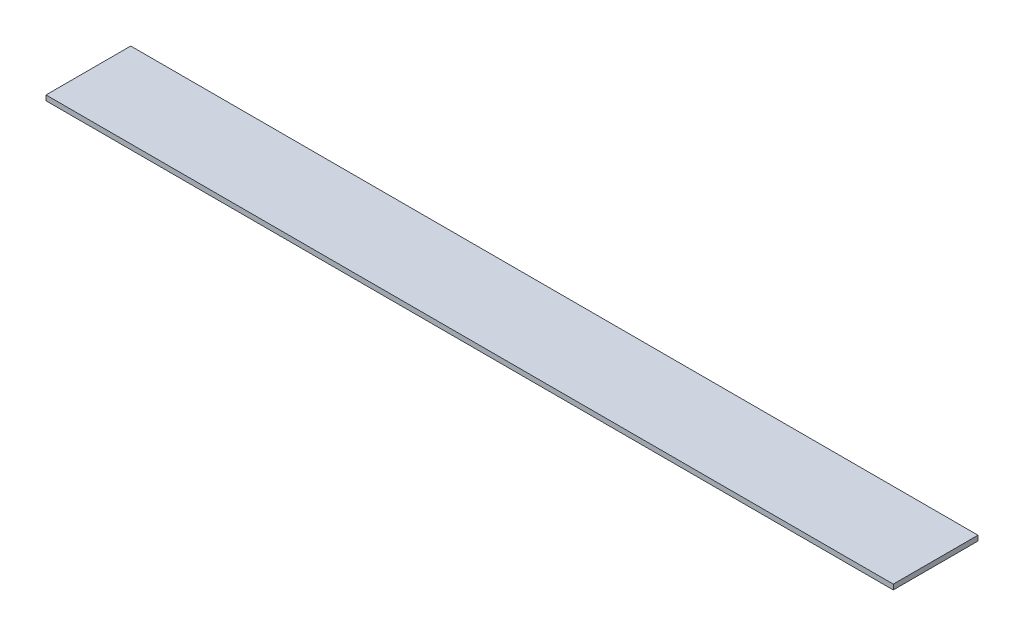
ISO-10303-21;
HEADER;
FILE_DESCRIPTION(('STEP AP214'),'2;1');
FILE_NAME('part.step','',(''),(''),'','','');
FILE_SCHEMA(('AUTOMOTIVE_DESIGN { 1 0 10303 214 1 1 1 1 }'));
ENDSEC;
DATA;
#1=APPLICATION_CONTEXT('core data for automotive mechanical design processes');
#2=APPLICATION_PROTOCOL_DEFINITION('international standard','automotive_design',2000,#1);
#3=PRODUCT_CONTEXT('',#1,'mechanical');
#4=PRODUCT('Part','Part','',(#3));
#5=PRODUCT_RELATED_PRODUCT_CATEGORY('part','',(#4));
#6=PRODUCT_DEFINITION_FORMATION('','',#4);
#7=PRODUCT_DEFINITION_CONTEXT('part definition',#1,'design');
#8=PRODUCT_DEFINITION('design','',#6,#7);
#9=PRODUCT_DEFINITION_SHAPE('','',#8);
#10=(LENGTH_UNIT() NAMED_UNIT(*) SI_UNIT(.MILLI.,.METRE.));
#11=(NAMED_UNIT(*) PLANE_ANGLE_UNIT() SI_UNIT($,.RADIAN.));
#12=(NAMED_UNIT(*) SI_UNIT($,.STERADIAN.) SOLID_ANGLE_UNIT());
#13=UNCERTAINTY_MEASURE_WITH_UNIT(LENGTH_MEASURE(1.E-05),#10,'distance_accuracy_value','');
#14=(GEOMETRIC_REPRESENTATION_CONTEXT(3) GLOBAL_UNCERTAINTY_ASSIGNED_CONTEXT((#13)) GLOBAL_UNIT_ASSIGNED_CONTEXT((#10,
#11,#12)) REPRESENTATION_CONTEXT('',''));
#15=CARTESIAN_POINT('',(0.,0.,0.));
#16=DIRECTION('',(0.,0.,1.));
#17=DIRECTION('',(1.,0.,0.));
#18=AXIS2_PLACEMENT_3D('',#15,#16,#17);
#19=CARTESIAN_POINT('',(250.,3.,-25.));
#20=DIRECTION('',(-1.,0.,0.));
#21=DIRECTION('',(0.,0.,1.));
#22=AXIS2_PLACEMENT_3D('',#19,#20,#21);
#23=PLANE('',#22);
#24=DIRECTION('',(0.,0.,-1.));
#25=VECTOR('',#24,1.);
#26=CARTESIAN_POINT('',(250.,0.,-25.));
#27=LINE('',#26,#25);
#28=CARTESIAN_POINT('',(250.,0.,25.));
#29=VERTEX_POINT('',#28);
#30=CARTESIAN_POINT('',(250.,0.,-25.));
#31=VERTEX_POINT('',#30);
#32=EDGE_CURVE('E96',#29,#31,#27,.T.);
#33=ORIENTED_EDGE('',*,*,#32,.T.);
#34=DIRECTION('',(0.,-1.,0.));
#35=VECTOR('',#34,1.);
#36=CARTESIAN_POINT('',(250.,3.,-25.));
#37=LINE('',#36,#35);
#38=CARTESIAN_POINT('',(250.,3.,-25.));
#39=VERTEX_POINT('',#38);
#40=EDGE_CURVE('E11',#39,#31,#37,.T.);
#41=ORIENTED_EDGE('',*,*,#40,.F.);
#42=DIRECTION('',(0.,0.,-1.));
#43=VECTOR('',#42,1.);
#44=CARTESIAN_POINT('',(250.,3.,-25.));
#45=LINE('',#44,#43);
#46=CARTESIAN_POINT('',(250.,3.,25.));
#47=VERTEX_POINT('',#46);
#48=EDGE_CURVE('E84',#47,#39,#45,.T.);
#49=ORIENTED_EDGE('',*,*,#48,.F.);
#50=DIRECTION('',(0.,-1.,0.));
#51=VECTOR('',#50,1.);
#52=CARTESIAN_POINT('',(250.,3.,25.));
#53=LINE('',#52,#51);
#54=EDGE_CURVE('E92',#47,#29,#53,.T.);
#55=ORIENTED_EDGE('',*,*,#54,.T.);
#56=EDGE_LOOP('',(#33,#41,#49,#55));
#57=FACE_BOUND('',#56,.T.);
#58=ADVANCED_FACE('F33',(#57),#23,.F.);
#59=CARTESIAN_POINT('',(-250.,3.,-25.));
#60=DIRECTION('',(0.,0.,1.));
#61=DIRECTION('',(1.,0.,0.));
#62=AXIS2_PLACEMENT_3D('',#59,#60,#61);
#63=PLANE('',#62);
#64=DIRECTION('',(-1.,0.,0.));
#65=VECTOR('',#64,1.);
#66=CARTESIAN_POINT('',(-250.,0.,-25.));
#67=LINE('',#66,#65);
#68=CARTESIAN_POINT('',(-250.,0.,-25.));
#69=VERTEX_POINT('',#68);
#70=EDGE_CURVE('E88',#31,#69,#67,.T.);
#71=ORIENTED_EDGE('',*,*,#70,.T.);
#72=DIRECTION('',(0.,-1.,0.));
#73=VECTOR('',#72,1.);
#74=CARTESIAN_POINT('',(-250.,3.,-25.));
#75=LINE('',#74,#73);
#76=CARTESIAN_POINT('',(-250.,3.,-25.));
#77=VERTEX_POINT('',#76);
#78=EDGE_CURVE('E41',#77,#69,#75,.T.);
#79=ORIENTED_EDGE('',*,*,#78,.F.);
#80=DIRECTION('',(-1.,0.,0.));
#81=VECTOR('',#80,1.);
#82=CARTESIAN_POINT('',(-250.,3.,-25.));
#83=LINE('',#82,#81);
#84=EDGE_CURVE('E79',#39,#77,#83,.T.);
#85=ORIENTED_EDGE('',*,*,#84,.F.);
#86=ORIENTED_EDGE('',*,*,#40,.T.);
#87=EDGE_LOOP('',(#71,#79,#85,#86));
#88=FACE_BOUND('',#87,.T.);
#89=ADVANCED_FACE('F87',(#88),#63,.F.);
#90=CARTESIAN_POINT('',(-250.,3.,25.));
#91=DIRECTION('',(1.,0.,0.));
#92=DIRECTION('',(0.,0.,-1.));
#93=AXIS2_PLACEMENT_3D('',#90,#91,#92);
#94=PLANE('',#93);
#95=DIRECTION('',(0.,0.,1.));
#96=VECTOR('',#95,1.);
#97=CARTESIAN_POINT('',(-250.,0.,25.));
#98=LINE('',#97,#96);
#99=CARTESIAN_POINT('',(-250.,0.,25.));
#100=VERTEX_POINT('',#99);
#101=EDGE_CURVE('E66',#69,#100,#98,.T.);
#102=ORIENTED_EDGE('',*,*,#101,.T.);
#103=DIRECTION('',(0.,-1.,0.));
#104=VECTOR('',#103,1.);
#105=CARTESIAN_POINT('',(-250.,3.,25.));
#106=LINE('',#105,#104);
#107=CARTESIAN_POINT('',(-250.,3.,25.));
#108=VERTEX_POINT('',#107);
#109=EDGE_CURVE('E89',#108,#100,#106,.T.);
#110=ORIENTED_EDGE('',*,*,#109,.F.);
#111=DIRECTION('',(0.,0.,1.));
#112=VECTOR('',#111,1.);
#113=CARTESIAN_POINT('',(-250.,3.,25.));
#114=LINE('',#113,#112);
#115=EDGE_CURVE('E82',#77,#108,#114,.T.);
#116=ORIENTED_EDGE('',*,*,#115,.F.);
#117=ORIENTED_EDGE('',*,*,#78,.T.);
#118=EDGE_LOOP('',(#102,#110,#116,#117));
#119=FACE_BOUND('',#118,.T.);
#120=ADVANCED_FACE('F90',(#119),#94,.F.);
#121=CARTESIAN_POINT('',(250.,3.,25.));
#122=DIRECTION('',(0.,0.,-1.));
#123=DIRECTION('',(-1.,0.,0.));
#124=AXIS2_PLACEMENT_3D('',#121,#122,#123);
#125=PLANE('',#124);
#126=DIRECTION('',(1.,0.,0.));
#127=VECTOR('',#126,1.);
#128=CARTESIAN_POINT('',(250.,0.,25.));
#129=LINE('',#128,#127);
#130=EDGE_CURVE('E72',#100,#29,#129,.T.);
#131=ORIENTED_EDGE('',*,*,#130,.T.);
#132=ORIENTED_EDGE('',*,*,#54,.F.);
#133=DIRECTION('',(1.,0.,0.));
#134=VECTOR('',#133,1.);
#135=CARTESIAN_POINT('',(250.,3.,25.));
#136=LINE('',#135,#134);
#137=EDGE_CURVE('E49',#108,#47,#136,.T.);
#138=ORIENTED_EDGE('',*,*,#137,.F.);
#139=ORIENTED_EDGE('',*,*,#109,.T.);
#140=EDGE_LOOP('',(#131,#132,#138,#139));
#141=FACE_BOUND('',#140,.T.);
#142=ADVANCED_FACE('F103',(#141),#125,.F.);
#143=CARTESIAN_POINT('',(0.,3.,0.));
#144=DIRECTION('',(0.,-1.,0.));
#145=DIRECTION('',(0.,0.,-1.));
#146=AXIS2_PLACEMENT_3D('',#143,#144,#145);
#147=PLANE('',#146);
#148=ORIENTED_EDGE('',*,*,#48,.T.);
#149=ORIENTED_EDGE('',*,*,#84,.T.);
#150=ORIENTED_EDGE('',*,*,#115,.T.);
#151=ORIENTED_EDGE('',*,*,#137,.T.);
#152=EDGE_LOOP('',(#148,#149,#150,#151));
#153=FACE_BOUND('',#152,.T.);
#154=ADVANCED_FACE('F80',(#153),#147,.F.);
#155=CARTESIAN_POINT('',(0.,0.,0.));
#156=DIRECTION('',(0.,-1.,0.));
#157=DIRECTION('',(0.,0.,-1.));
#158=AXIS2_PLACEMENT_3D('',#155,#156,#157);
#159=PLANE('',#158);
#160=ORIENTED_EDGE('',*,*,#32,.F.);
#161=ORIENTED_EDGE('',*,*,#130,.F.);
#162=ORIENTED_EDGE('',*,*,#101,.F.);
#163=ORIENTED_EDGE('',*,*,#70,.F.);
#164=EDGE_LOOP('',(#160,#161,#162,#163));
#165=FACE_BOUND('',#164,.T.);
#166=ADVANCED_FACE('F106',(#165),#159,.T.);
#167=CLOSED_SHELL('',(#58,#89,#120,#142,#154,#166));
#168=MANIFOLD_SOLID_BREP('B2',#167);
#169=ADVANCED_BREP_SHAPE_REPRESENTATION('',(#18,#168),#14);
#170=SHAPE_DEFINITION_REPRESENTATION(#9,#169);
ENDSEC;
END-ISO-10303-21;
